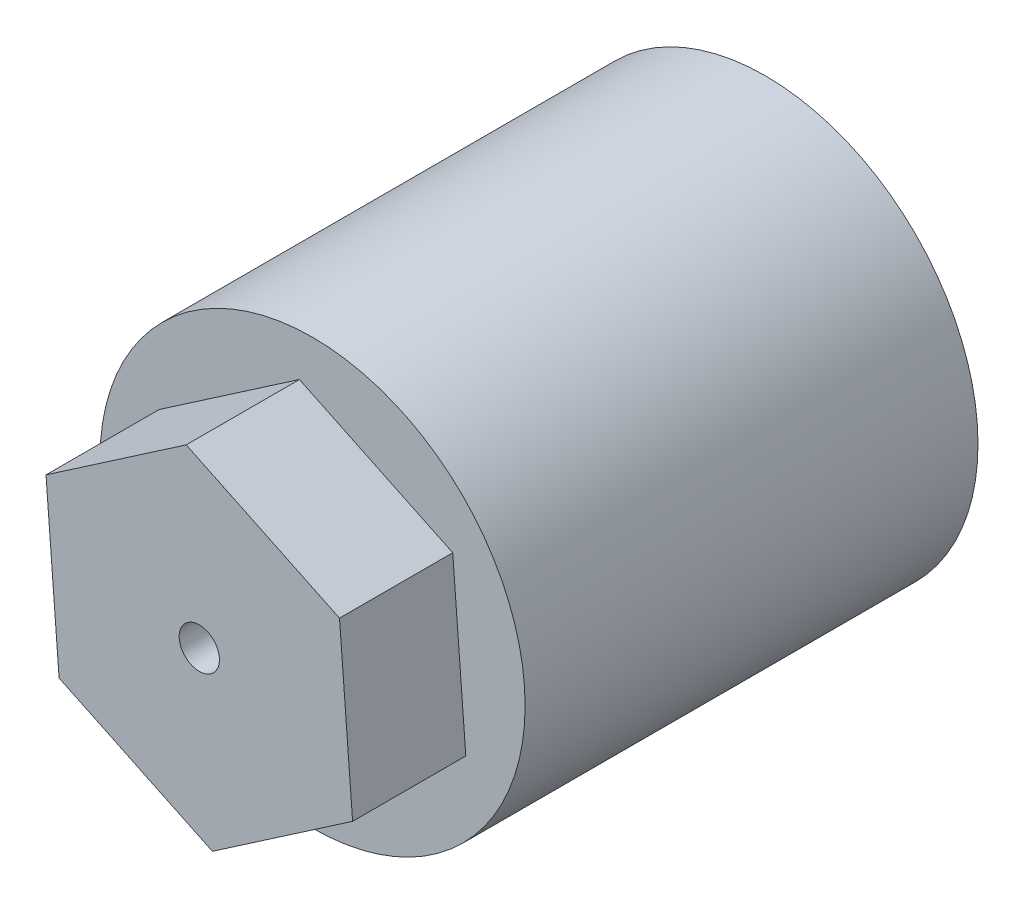
ISO-10303-21;
HEADER;
FILE_DESCRIPTION(('STEP AP214'),'2;1');
FILE_NAME('part.step','',(''),(''),'','','');
FILE_SCHEMA(('AUTOMOTIVE_DESIGN { 1 0 10303 214 1 1 1 1 }'));
ENDSEC;
DATA;
#1=APPLICATION_CONTEXT('core data for automotive mechanical design processes');
#2=APPLICATION_PROTOCOL_DEFINITION('international standard','automotive_design',2000,#1);
#3=PRODUCT_CONTEXT('',#1,'mechanical');
#4=PRODUCT('Part','Part','',(#3));
#5=PRODUCT_RELATED_PRODUCT_CATEGORY('part','',(#4));
#6=PRODUCT_DEFINITION_FORMATION('','',#4);
#7=PRODUCT_DEFINITION_CONTEXT('part definition',#1,'design');
#8=PRODUCT_DEFINITION('design','',#6,#7);
#9=PRODUCT_DEFINITION_SHAPE('','',#8);
#10=(LENGTH_UNIT() NAMED_UNIT(*) SI_UNIT(.MILLI.,.METRE.));
#11=(NAMED_UNIT(*) PLANE_ANGLE_UNIT() SI_UNIT($,.RADIAN.));
#12=(NAMED_UNIT(*) SI_UNIT($,.STERADIAN.) SOLID_ANGLE_UNIT());
#13=UNCERTAINTY_MEASURE_WITH_UNIT(LENGTH_MEASURE(1.E-05),#10,'distance_accuracy_value','');
#14=(GEOMETRIC_REPRESENTATION_CONTEXT(3) GLOBAL_UNCERTAINTY_ASSIGNED_CONTEXT((#13)) GLOBAL_UNIT_ASSIGNED_CONTEXT((#10,
#11,#12)) REPRESENTATION_CONTEXT('',''));
#15=CARTESIAN_POINT('',(0.,0.,0.));
#16=DIRECTION('',(0.,0.,1.));
#17=DIRECTION('',(1.,0.,0.));
#18=AXIS2_PLACEMENT_3D('',#15,#16,#17);
#19=CARTESIAN_POINT('',(0.,0.,-2.));
#20=DIRECTION('',(0.,0.,1.));
#21=DIRECTION('',(1.,0.,0.));
#22=AXIS2_PLACEMENT_3D('',#19,#20,#21);
#23=CYLINDRICAL_SURFACE('',#22,0.8);
#24=CARTESIAN_POINT('',(0.,0.,-2.));
#25=DIRECTION('',(0.,0.,-1.));
#26=DIRECTION('',(-1.,0.,0.));
#27=AXIS2_PLACEMENT_3D('',#24,#25,#26);
#28=CIRCLE('',#27,0.8);
#29=CARTESIAN_POINT('',(-0.8,0.,-2.));
#30=VERTEX_POINT('',#29);
#31=EDGE_CURVE('E211',#30,#30,#28,.F.);
#32=ORIENTED_EDGE('',*,*,#31,.F.);
#33=EDGE_LOOP('',(#32));
#34=FACE_BOUND('',#33,.T.);
#35=CARTESIAN_POINT('',(0.,0.,4.5));
#36=DIRECTION('',(0.,0.,1.));
#37=DIRECTION('',(1.,0.,0.));
#38=AXIS2_PLACEMENT_3D('',#35,#36,#37);
#39=CIRCLE('',#38,0.8);
#40=CARTESIAN_POINT('',(0.8,0.,4.5));
#41=VERTEX_POINT('',#40);
#42=EDGE_CURVE('E217',#41,#41,#39,.T.);
#43=ORIENTED_EDGE('',*,*,#42,.T.);
#44=EDGE_LOOP('',(#43));
#45=FACE_BOUND('',#44,.T.);
#46=ADVANCED_FACE('F33',(#34,#45),#23,.F.);
#47=CARTESIAN_POINT('',(6.09293850012048,-2.91652197553002,4.5));
#48=DIRECTION('',(-0.997024775357718,-0.077081757393637,0.));
#49=DIRECTION('',(0.0770817573936371,-0.997024775357718,0.));
#50=AXIS2_PLACEMENT_3D('',#47,#48,#49);
#51=PLANE('',#50);
#52=DIRECTION('',(-0.0770817573936371,0.997024775357718,0.));
#53=VECTOR('',#52,1.);
#54=CARTESIAN_POINT('',(6.09293850012048,-2.91652197553002,0.));
#55=LINE('',#54,#53);
#56=CARTESIAN_POINT('',(6.09293850012048,-2.91652197553002,0.));
#57=VERTEX_POINT('',#56);
#58=CARTESIAN_POINT('',(5.57225137156482,3.81837853703558,0.));
#59=VERTEX_POINT('',#58);
#60=EDGE_CURVE('E70',#57,#59,#55,.T.);
#61=ORIENTED_EDGE('',*,*,#60,.T.);
#62=DIRECTION('',(0.,0.,-1.));
#63=VECTOR('',#62,1.);
#64=CARTESIAN_POINT('',(5.57225137156482,3.81837853703558,4.5));
#65=LINE('',#64,#63);
#66=CARTESIAN_POINT('',(5.57225137156482,3.81837853703558,4.5));
#67=VERTEX_POINT('',#66);
#68=EDGE_CURVE('E11',#67,#59,#65,.T.);
#69=ORIENTED_EDGE('',*,*,#68,.F.);
#70=DIRECTION('',(-0.0770817573936371,0.997024775357718,0.));
#71=VECTOR('',#70,1.);
#72=CARTESIAN_POINT('',(6.09293850012048,-2.91652197553002,4.5));
#73=LINE('',#72,#71);
#74=CARTESIAN_POINT('',(6.09293850012048,-2.91652197553002,4.5));
#75=VERTEX_POINT('',#74);
#76=EDGE_CURVE('E132',#75,#67,#73,.T.);
#77=ORIENTED_EDGE('',*,*,#76,.F.);
#78=DIRECTION('',(0.,0.,-1.));
#79=VECTOR('',#78,1.);
#80=CARTESIAN_POINT('',(6.09293850012048,-2.91652197553002,4.5));
#81=LINE('',#80,#79);
#82=EDGE_CURVE('E117',#75,#57,#81,.T.);
#83=ORIENTED_EDGE('',*,*,#82,.T.);
#84=EDGE_LOOP('',(#61,#69,#77,#83));
#85=FACE_BOUND('',#84,.T.);
#86=ADVANCED_FACE('F35',(#85),#51,.F.);
#87=CARTESIAN_POINT('',(5.57225137156482,3.81837853703558,4.5));
#88=DIRECTION('',(-0.431757627607621,-0.901989662359076,0.));
#89=DIRECTION('',(0.901989662359076,-0.431757627607621,0.));
#90=AXIS2_PLACEMENT_3D('',#87,#88,#89);
#91=PLANE('',#90);
#92=DIRECTION('',(-0.901989662359076,0.431757627607621,0.));
#93=VECTOR('',#92,1.);
#94=CARTESIAN_POINT('',(5.57225137156482,3.81837853703558,0.));
#95=LINE('',#94,#93);
#96=CARTESIAN_POINT('',(-0.520687128555659,6.7349005125656,0.));
#97=VERTEX_POINT('',#96);
#98=EDGE_CURVE('E79',#59,#97,#95,.T.);
#99=ORIENTED_EDGE('',*,*,#98,.T.);
#100=DIRECTION('',(0.,0.,-1.));
#101=VECTOR('',#100,1.);
#102=CARTESIAN_POINT('',(-0.520687128555659,6.7349005125656,4.5));
#103=LINE('',#102,#101);
#104=CARTESIAN_POINT('',(-0.520687128555659,6.7349005125656,4.5));
#105=VERTEX_POINT('',#104);
#106=EDGE_CURVE('E41',#105,#97,#103,.T.);
#107=ORIENTED_EDGE('',*,*,#106,.F.);
#108=DIRECTION('',(-0.901989662359076,0.431757627607621,0.));
#109=VECTOR('',#108,1.);
#110=CARTESIAN_POINT('',(5.57225137156482,3.81837853703558,4.5));
#111=LINE('',#110,#109);
#112=EDGE_CURVE('E142',#67,#105,#111,.T.);
#113=ORIENTED_EDGE('',*,*,#112,.F.);
#114=ORIENTED_EDGE('',*,*,#68,.T.);
#115=EDGE_LOOP('',(#99,#107,#113,#114));
#116=FACE_BOUND('',#115,.T.);
#117=ADVANCED_FACE('F141',(#116),#91,.F.);
#118=CARTESIAN_POINT('',(-0.520687128555659,6.7349005125656,4.5));
#119=DIRECTION('',(0.565267147750098,-0.824907904965438,0.));
#120=DIRECTION('',(0.824907904965439,0.565267147750098,0.));
#121=AXIS2_PLACEMENT_3D('',#118,#119,#120);
#122=PLANE('',#121);
#123=DIRECTION('',(-0.824907904965439,-0.565267147750098,0.));
#124=VECTOR('',#123,1.);
#125=CARTESIAN_POINT('',(-0.520687128555659,6.7349005125656,0.));
#126=LINE('',#125,#124);
#127=CARTESIAN_POINT('',(-6.09293850012048,2.91652197553002,0.));
#128=VERTEX_POINT('',#127);
#129=EDGE_CURVE('E124',#97,#128,#126,.T.);
#130=ORIENTED_EDGE('',*,*,#129,.T.);
#131=DIRECTION('',(0.,0.,-1.));
#132=VECTOR('',#131,1.);
#133=CARTESIAN_POINT('',(-6.09293850012048,2.91652197553002,4.5));
#134=LINE('',#133,#132);
#135=CARTESIAN_POINT('',(-6.09293850012048,2.91652197553002,4.5));
#136=VERTEX_POINT('',#135);
#137=EDGE_CURVE('E111',#136,#128,#134,.T.);
#138=ORIENTED_EDGE('',*,*,#137,.F.);
#139=DIRECTION('',(-0.824907904965439,-0.565267147750098,0.));
#140=VECTOR('',#139,1.);
#141=CARTESIAN_POINT('',(-0.520687128555659,6.7349005125656,4.5));
#142=LINE('',#141,#140);
#143=EDGE_CURVE('E97',#105,#136,#142,.T.);
#144=ORIENTED_EDGE('',*,*,#143,.F.);
#145=ORIENTED_EDGE('',*,*,#106,.T.);
#146=EDGE_LOOP('',(#130,#138,#144,#145));
#147=FACE_BOUND('',#146,.T.);
#148=ADVANCED_FACE('F139',(#147),#122,.F.);
#149=CARTESIAN_POINT('',(-6.09293850012048,2.91652197553002,4.5));
#150=DIRECTION('',(0.997024775357718,0.0770817573936372,0.));
#151=DIRECTION('',(-0.0770817573936372,0.997024775357718,0.));
#152=AXIS2_PLACEMENT_3D('',#149,#150,#151);
#153=PLANE('',#152);
#154=DIRECTION('',(0.0770817573936372,-0.997024775357718,0.));
#155=VECTOR('',#154,1.);
#156=CARTESIAN_POINT('',(-6.09293850012048,2.91652197553002,0.));
#157=LINE('',#156,#155);
#158=CARTESIAN_POINT('',(-5.57225137156482,-3.81837853703558,0.));
#159=VERTEX_POINT('',#158);
#160=EDGE_CURVE('E108',#128,#159,#157,.T.);
#161=ORIENTED_EDGE('',*,*,#160,.T.);
#162=DIRECTION('',(0.,0.,-1.));
#163=VECTOR('',#162,1.);
#164=CARTESIAN_POINT('',(-5.57225137156482,-3.81837853703558,4.5));
#165=LINE('',#164,#163);
#166=CARTESIAN_POINT('',(-5.57225137156482,-3.81837853703558,4.5));
#167=VERTEX_POINT('',#166);
#168=EDGE_CURVE('E104',#167,#159,#165,.T.);
#169=ORIENTED_EDGE('',*,*,#168,.F.);
#170=DIRECTION('',(0.0770817573936372,-0.997024775357718,0.));
#171=VECTOR('',#170,1.);
#172=CARTESIAN_POINT('',(-6.09293850012048,2.91652197553002,4.5));
#173=LINE('',#172,#171);
#174=EDGE_CURVE('E90',#136,#167,#173,.T.);
#175=ORIENTED_EDGE('',*,*,#174,.F.);
#176=ORIENTED_EDGE('',*,*,#137,.T.);
#177=EDGE_LOOP('',(#161,#169,#175,#176));
#178=FACE_BOUND('',#177,.T.);
#179=ADVANCED_FACE('F105',(#178),#153,.F.);
#180=CARTESIAN_POINT('',(-5.57225137156482,-3.81837853703558,4.5));
#181=DIRECTION('',(0.431757627607621,0.901989662359076,0.));
#182=DIRECTION('',(-0.901989662359076,0.431757627607621,0.));
#183=AXIS2_PLACEMENT_3D('',#180,#181,#182);
#184=PLANE('',#183);
#185=DIRECTION('',(0.901989662359076,-0.431757627607621,0.));
#186=VECTOR('',#185,1.);
#187=CARTESIAN_POINT('',(-5.57225137156482,-3.81837853703558,0.));
#188=LINE('',#187,#186);
#189=CARTESIAN_POINT('',(0.52068712855566,-6.73490051256561,0.));
#190=VERTEX_POINT('',#189);
#191=EDGE_CURVE('E128',#159,#190,#188,.T.);
#192=ORIENTED_EDGE('',*,*,#191,.T.);
#193=DIRECTION('',(0.,0.,-1.));
#194=VECTOR('',#193,1.);
#195=CARTESIAN_POINT('',(0.52068712855566,-6.73490051256561,4.5));
#196=LINE('',#195,#194);
#197=CARTESIAN_POINT('',(0.52068712855566,-6.73490051256561,4.5));
#198=VERTEX_POINT('',#197);
#199=EDGE_CURVE('E112',#198,#190,#196,.T.);
#200=ORIENTED_EDGE('',*,*,#199,.F.);
#201=DIRECTION('',(0.901989662359076,-0.431757627607621,0.));
#202=VECTOR('',#201,1.);
#203=CARTESIAN_POINT('',(-5.57225137156482,-3.81837853703558,4.5));
#204=LINE('',#203,#202);
#205=EDGE_CURVE('E94',#167,#198,#204,.T.);
#206=ORIENTED_EDGE('',*,*,#205,.F.);
#207=ORIENTED_EDGE('',*,*,#168,.T.);
#208=EDGE_LOOP('',(#192,#200,#206,#207));
#209=FACE_BOUND('',#208,.T.);
#210=ADVANCED_FACE('F114',(#209),#184,.F.);
#211=CARTESIAN_POINT('',(0.52068712855566,-6.73490051256561,4.5));
#212=DIRECTION('',(-0.565267147750098,0.824907904965438,0.));
#213=DIRECTION('',(-0.824907904965439,-0.565267147750098,0.));
#214=AXIS2_PLACEMENT_3D('',#211,#212,#213);
#215=PLANE('',#214);
#216=DIRECTION('',(0.824907904965439,0.565267147750098,0.));
#217=VECTOR('',#216,1.);
#218=CARTESIAN_POINT('',(0.52068712855566,-6.73490051256561,0.));
#219=LINE('',#218,#217);
#220=EDGE_CURVE('E130',#190,#57,#219,.T.);
#221=ORIENTED_EDGE('',*,*,#220,.T.);
#222=ORIENTED_EDGE('',*,*,#82,.F.);
#223=DIRECTION('',(0.824907904965439,0.565267147750098,0.));
#224=VECTOR('',#223,1.);
#225=CARTESIAN_POINT('',(0.52068712855566,-6.73490051256561,4.5));
#226=LINE('',#225,#224);
#227=EDGE_CURVE('E57',#198,#75,#226,.T.);
#228=ORIENTED_EDGE('',*,*,#227,.F.);
#229=ORIENTED_EDGE('',*,*,#199,.T.);
#230=EDGE_LOOP('',(#221,#222,#228,#229));
#231=FACE_BOUND('',#230,.T.);
#232=ADVANCED_FACE('F147',(#231),#215,.F.);
#233=CARTESIAN_POINT('',(0.,0.,4.5));
#234=DIRECTION('',(0.,0.,1.));
#235=DIRECTION('',(1.,0.,0.));
#236=AXIS2_PLACEMENT_3D('',#233,#234,#235);
#237=PLANE('',#236);
#238=ORIENTED_EDGE('',*,*,#42,.F.);
#239=EDGE_LOOP('',(#238));
#240=FACE_BOUND('',#239,.T.);
#241=ORIENTED_EDGE('',*,*,#76,.T.);
#242=ORIENTED_EDGE('',*,*,#112,.T.);
#243=ORIENTED_EDGE('',*,*,#143,.T.);
#244=ORIENTED_EDGE('',*,*,#174,.T.);
#245=ORIENTED_EDGE('',*,*,#205,.T.);
#246=ORIENTED_EDGE('',*,*,#227,.T.);
#247=EDGE_LOOP('',(#241,#242,#243,#244,#245,#246));
#248=FACE_BOUND('',#247,.T.);
#249=ADVANCED_FACE('F92',(#240,#248),#237,.T.);
#250=CARTESIAN_POINT('',(0.,0.,0.));
#251=DIRECTION('',(0.,0.,-1.));
#252=DIRECTION('',(-1.,0.,0.));
#253=AXIS2_PLACEMENT_3D('',#250,#251,#252);
#254=PLANE('',#253);
#255=CARTESIAN_POINT('',(0.,0.,0.));
#256=DIRECTION('',(0.,0.,-1.));
#257=DIRECTION('',(-1.,0.,0.));
#258=AXIS2_PLACEMENT_3D('',#255,#256,#257);
#259=CIRCLE('',#258,8.45);
#260=CARTESIAN_POINT('',(-8.45,0.,0.));
#261=VERTEX_POINT('',#260);
#262=EDGE_CURVE('E220',#261,#261,#259,.T.);
#263=ORIENTED_EDGE('',*,*,#262,.F.);
#264=EDGE_LOOP('',(#263));
#265=FACE_BOUND('',#264,.T.);
#266=ORIENTED_EDGE('',*,*,#98,.F.);
#267=ORIENTED_EDGE('',*,*,#60,.F.);
#268=ORIENTED_EDGE('',*,*,#220,.F.);
#269=ORIENTED_EDGE('',*,*,#191,.F.);
#270=ORIENTED_EDGE('',*,*,#160,.F.);
#271=ORIENTED_EDGE('',*,*,#129,.F.);
#272=EDGE_LOOP('',(#266,#267,#268,#269,#270,#271));
#273=FACE_BOUND('',#272,.T.);
#274=ADVANCED_FACE('F150',(#265,#273),#254,.F.);
#275=CARTESIAN_POINT('',(0.,0.,-18.));
#276=DIRECTION('',(0.,0.,1.));
#277=DIRECTION('',(1.,0.,0.));
#278=AXIS2_PLACEMENT_3D('',#275,#276,#277);
#279=CYLINDRICAL_SURFACE('',#278,8.45);
#280=CARTESIAN_POINT('',(0.,0.,-18.));
#281=DIRECTION('',(0.,0.,-1.));
#282=DIRECTION('',(-1.,0.,0.));
#283=AXIS2_PLACEMENT_3D('',#280,#281,#282);
#284=CIRCLE('',#283,8.45);
#285=CARTESIAN_POINT('',(-8.45,0.,-18.));
#286=VERTEX_POINT('',#285);
#287=EDGE_CURVE('E122',#286,#286,#284,.T.);
#288=ORIENTED_EDGE('',*,*,#287,.F.);
#289=EDGE_LOOP('',(#288));
#290=FACE_BOUND('',#289,.T.);
#291=ORIENTED_EDGE('',*,*,#262,.T.);
#292=EDGE_LOOP('',(#291));
#293=FACE_BOUND('',#292,.T.);
#294=ADVANCED_FACE('F228',(#290,#293),#279,.T.);
#295=CARTESIAN_POINT('',(0.,0.,-18.));
#296=DIRECTION('',(0.,0.,-1.));
#297=DIRECTION('',(-1.,0.,0.));
#298=AXIS2_PLACEMENT_3D('',#295,#296,#297);
#299=PLANE('',#298);
#300=CARTESIAN_POINT('',(0.,0.,-18.));
#301=DIRECTION('',(0.,0.,-1.));
#302=DIRECTION('',(-1.,0.,0.));
#303=AXIS2_PLACEMENT_3D('',#300,#301,#302);
#304=CIRCLE('',#303,2.7);
#305=CARTESIAN_POINT('',(-1.96590919918955,-1.85072986157945,-18.));
#306=VERTEX_POINT('',#305);
#307=CARTESIAN_POINT('',(-1.96590919918955,1.85072986157945,-18.));
#308=VERTEX_POINT('',#307);
#309=EDGE_CURVE('E48',#306,#308,#304,.T.);
#310=ORIENTED_EDGE('',*,*,#309,.F.);
#311=DIRECTION('',(-1.,0.,0.));
#312=VECTOR('',#311,1.);
#313=CARTESIAN_POINT('',(1.96590919918955,-1.85072986157945,-18.));
#314=LINE('',#313,#312);
#315=CARTESIAN_POINT('',(1.96590919918955,-1.85072986157945,-18.));
#316=VERTEX_POINT('',#315);
#317=EDGE_CURVE('E196',#316,#306,#314,.T.);
#318=ORIENTED_EDGE('',*,*,#317,.F.);
#319=CARTESIAN_POINT('',(0.,0.,-18.));
#320=DIRECTION('',(0.,0.,-1.));
#321=DIRECTION('',(-1.,0.,0.));
#322=AXIS2_PLACEMENT_3D('',#319,#320,#321);
#323=CIRCLE('',#322,2.7);
#324=CARTESIAN_POINT('',(1.96590919918955,1.85072986157945,-18.));
#325=VERTEX_POINT('',#324);
#326=EDGE_CURVE('E199',#325,#316,#323,.T.);
#327=ORIENTED_EDGE('',*,*,#326,.F.);
#328=DIRECTION('',(1.,0.,0.));
#329=VECTOR('',#328,1.);
#330=CARTESIAN_POINT('',(1.96590919918955,1.85072986157945,-18.));
#331=LINE('',#330,#329);
#332=EDGE_CURVE('E205',#308,#325,#331,.T.);
#333=ORIENTED_EDGE('',*,*,#332,.F.);
#334=EDGE_LOOP('',(#310,#318,#327,#333));
#335=FACE_BOUND('',#334,.T.);
#336=ORIENTED_EDGE('',*,*,#287,.T.);
#337=EDGE_LOOP('',(#336));
#338=FACE_BOUND('',#337,.T.);
#339=ADVANCED_FACE('F236',(#335,#338),#299,.T.);
#340=CARTESIAN_POINT('',(0.,0.,-2.));
#341=DIRECTION('',(0.,0.,-1.));
#342=DIRECTION('',(-1.,0.,0.));
#343=AXIS2_PLACEMENT_3D('',#340,#341,#342);
#344=PLANE('',#343);
#345=CARTESIAN_POINT('',(0.,0.,-2.));
#346=DIRECTION('',(0.,0.,-1.));
#347=DIRECTION('',(-1.,0.,0.));
#348=AXIS2_PLACEMENT_3D('',#345,#346,#347);
#349=CIRCLE('',#348,2.7);
#350=CARTESIAN_POINT('',(-1.96590919918955,-1.85072986157945,-2.));
#351=VERTEX_POINT('',#350);
#352=CARTESIAN_POINT('',(-1.96590919918955,1.85072986157945,-2.));
#353=VERTEX_POINT('',#352);
#354=EDGE_CURVE('E177',#351,#353,#349,.T.);
#355=ORIENTED_EDGE('',*,*,#354,.T.);
#356=DIRECTION('',(1.,0.,0.));
#357=VECTOR('',#356,1.);
#358=CARTESIAN_POINT('',(1.96590919918955,1.85072986157945,-2.));
#359=LINE('',#358,#357);
#360=CARTESIAN_POINT('',(1.96590919918955,1.85072986157945,-2.));
#361=VERTEX_POINT('',#360);
#362=EDGE_CURVE('E186',#353,#361,#359,.T.);
#363=ORIENTED_EDGE('',*,*,#362,.T.);
#364=CARTESIAN_POINT('',(0.,0.,-2.));
#365=DIRECTION('',(0.,0.,-1.));
#366=DIRECTION('',(-1.,0.,0.));
#367=AXIS2_PLACEMENT_3D('',#364,#365,#366);
#368=CIRCLE('',#367,2.7);
#369=CARTESIAN_POINT('',(1.96590919918955,-1.85072986157945,-2.));
#370=VERTEX_POINT('',#369);
#371=EDGE_CURVE('E191',#361,#370,#368,.T.);
#372=ORIENTED_EDGE('',*,*,#371,.T.);
#373=DIRECTION('',(-1.,0.,0.));
#374=VECTOR('',#373,1.);
#375=CARTESIAN_POINT('',(1.96590919918955,-1.85072986157945,-2.));
#376=LINE('',#375,#374);
#377=EDGE_CURVE('E183',#370,#351,#376,.T.);
#378=ORIENTED_EDGE('',*,*,#377,.T.);
#379=EDGE_LOOP('',(#355,#363,#372,#378));
#380=FACE_BOUND('',#379,.T.);
#381=ORIENTED_EDGE('',*,*,#31,.T.);
#382=EDGE_LOOP('',(#381));
#383=FACE_BOUND('',#382,.T.);
#384=ADVANCED_FACE('F193',(#380,#383),#344,.T.);
#385=CARTESIAN_POINT('',(0.,0.,-2.));
#386=DIRECTION('',(0.,0.,-1.));
#387=DIRECTION('',(-1.,0.,0.));
#388=AXIS2_PLACEMENT_3D('',#385,#386,#387);
#389=CYLINDRICAL_SURFACE('',#388,2.7);
#390=ORIENTED_EDGE('',*,*,#309,.T.);
#391=DIRECTION('',(0.,0.,-1.));
#392=VECTOR('',#391,1.);
#393=CARTESIAN_POINT('',(-1.96590919918955,1.85072986157945,-2.));
#394=LINE('',#393,#392);
#395=EDGE_CURVE('E173',#353,#308,#394,.T.);
#396=ORIENTED_EDGE('',*,*,#395,.F.);
#397=ORIENTED_EDGE('',*,*,#354,.F.);
#398=DIRECTION('',(0.,0.,-1.));
#399=VECTOR('',#398,1.);
#400=CARTESIAN_POINT('',(-1.96590919918955,-1.85072986157945,-2.));
#401=LINE('',#400,#399);
#402=EDGE_CURVE('E209',#351,#306,#401,.T.);
#403=ORIENTED_EDGE('',*,*,#402,.T.);
#404=EDGE_LOOP('',(#390,#396,#397,#403));
#405=FACE_BOUND('',#404,.T.);
#406=ADVANCED_FACE('F175',(#405),#389,.F.);
#407=CARTESIAN_POINT('',(1.96590919918955,-1.85072986157945,-2.));
#408=DIRECTION('',(0.,-1.,0.));
#409=DIRECTION('',(0.,0.,-1.));
#410=AXIS2_PLACEMENT_3D('',#407,#408,#409);
#411=PLANE('',#410);
#412=ORIENTED_EDGE('',*,*,#317,.T.);
#413=ORIENTED_EDGE('',*,*,#402,.F.);
#414=ORIENTED_EDGE('',*,*,#377,.F.);
#415=DIRECTION('',(0.,0.,-1.));
#416=VECTOR('',#415,1.);
#417=CARTESIAN_POINT('',(1.96590919918955,-1.85072986157945,-2.));
#418=LINE('',#417,#416);
#419=EDGE_CURVE('E212',#370,#316,#418,.T.);
#420=ORIENTED_EDGE('',*,*,#419,.T.);
#421=EDGE_LOOP('',(#412,#413,#414,#420));
#422=FACE_BOUND('',#421,.T.);
#423=ADVANCED_FACE('F265',(#422),#411,.F.);
#424=CARTESIAN_POINT('',(0.,0.,-2.));
#425=DIRECTION('',(0.,0.,-1.));
#426=DIRECTION('',(-1.,0.,0.));
#427=AXIS2_PLACEMENT_3D('',#424,#425,#426);
#428=CYLINDRICAL_SURFACE('',#427,2.7);
#429=ORIENTED_EDGE('',*,*,#326,.T.);
#430=ORIENTED_EDGE('',*,*,#419,.F.);
#431=ORIENTED_EDGE('',*,*,#371,.F.);
#432=DIRECTION('',(0.,0.,-1.));
#433=VECTOR('',#432,1.);
#434=CARTESIAN_POINT('',(1.96590919918955,1.85072986157945,-2.));
#435=LINE('',#434,#433);
#436=EDGE_CURVE('E182',#361,#325,#435,.T.);
#437=ORIENTED_EDGE('',*,*,#436,.T.);
#438=EDGE_LOOP('',(#429,#430,#431,#437));
#439=FACE_BOUND('',#438,.T.);
#440=ADVANCED_FACE('F263',(#439),#428,.F.);
#441=CARTESIAN_POINT('',(1.96590919918955,1.85072986157945,-2.));
#442=DIRECTION('',(0.,1.,0.));
#443=DIRECTION('',(0.,0.,1.));
#444=AXIS2_PLACEMENT_3D('',#441,#442,#443);
#445=PLANE('',#444);
#446=ORIENTED_EDGE('',*,*,#332,.T.);
#447=ORIENTED_EDGE('',*,*,#436,.F.);
#448=ORIENTED_EDGE('',*,*,#362,.F.);
#449=ORIENTED_EDGE('',*,*,#395,.T.);
#450=EDGE_LOOP('',(#446,#447,#448,#449));
#451=FACE_BOUND('',#450,.T.);
#452=ADVANCED_FACE('F187',(#451),#445,.F.);
#453=CLOSED_SHELL('',(#46,#86,#117,#148,#179,#210,#232,#249,#274,#294,#339,#384,#406,#423,#440,#452));
#454=MANIFOLD_SOLID_BREP('B2',#453);
#455=ADVANCED_BREP_SHAPE_REPRESENTATION('',(#18,#454),#14);
#456=SHAPE_DEFINITION_REPRESENTATION(#9,#455);
ENDSEC;
END-ISO-10303-21;
